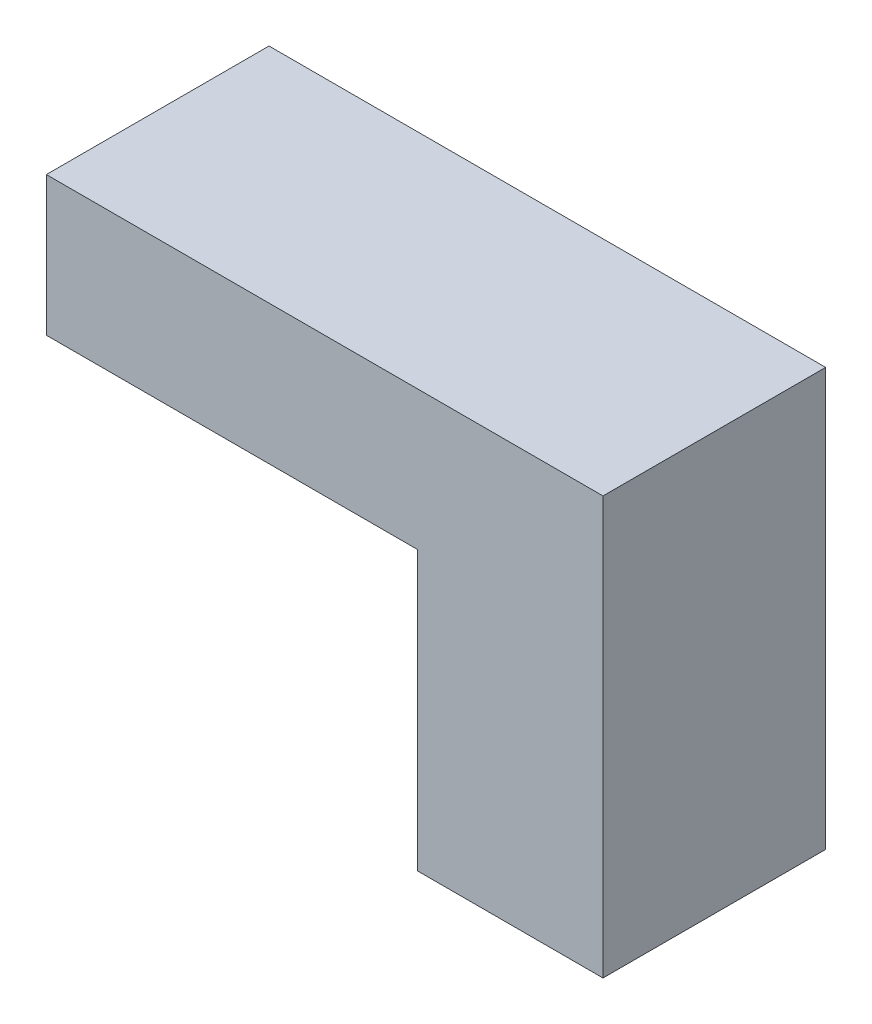
ISO-10303-21;
HEADER;
FILE_DESCRIPTION(('STEP AP214'),'2;1');
FILE_NAME('part.step','',(''),(''),'','','');
FILE_SCHEMA(('AUTOMOTIVE_DESIGN { 1 0 10303 214 1 1 1 1 }'));
ENDSEC;
DATA;
#1=APPLICATION_CONTEXT('core data for automotive mechanical design processes');
#2=APPLICATION_PROTOCOL_DEFINITION('international standard','automotive_design',2000,#1);
#3=PRODUCT_CONTEXT('',#1,'mechanical');
#4=PRODUCT('Part','Part','',(#3));
#5=PRODUCT_RELATED_PRODUCT_CATEGORY('part','',(#4));
#6=PRODUCT_DEFINITION_FORMATION('','',#4);
#7=PRODUCT_DEFINITION_CONTEXT('part definition',#1,'design');
#8=PRODUCT_DEFINITION('design','',#6,#7);
#9=PRODUCT_DEFINITION_SHAPE('','',#8);
#10=(LENGTH_UNIT() NAMED_UNIT(*) SI_UNIT(.MILLI.,.METRE.));
#11=(NAMED_UNIT(*) PLANE_ANGLE_UNIT() SI_UNIT($,.RADIAN.));
#12=(NAMED_UNIT(*) SI_UNIT($,.STERADIAN.) SOLID_ANGLE_UNIT());
#13=UNCERTAINTY_MEASURE_WITH_UNIT(LENGTH_MEASURE(1.E-05),#10,'distance_accuracy_value','');
#14=(GEOMETRIC_REPRESENTATION_CONTEXT(3) GLOBAL_UNCERTAINTY_ASSIGNED_CONTEXT((#13)) GLOBAL_UNIT_ASSIGNED_CONTEXT((#10,
#11,#12)) REPRESENTATION_CONTEXT('',''));
#15=CARTESIAN_POINT('',(0.,0.,0.));
#16=DIRECTION('',(0.,0.,1.));
#17=DIRECTION('',(1.,0.,0.));
#18=AXIS2_PLACEMENT_3D('',#15,#16,#17);
#19=CARTESIAN_POINT('',(0.,-3.81,6.096));
#20=DIRECTION('',(1.,0.,0.));
#21=DIRECTION('',(0.,0.,-1.));
#22=AXIS2_PLACEMENT_3D('',#19,#20,#21);
#23=PLANE('',#22);
#24=DIRECTION('',(0.,-1.,0.));
#25=VECTOR('',#24,1.);
#26=CARTESIAN_POINT('',(0.,-3.81,0.));
#27=LINE('',#26,#25);
#28=CARTESIAN_POINT('',(0.,0.,0.));
#29=VERTEX_POINT('',#28);
#30=CARTESIAN_POINT('',(0.,-3.81,0.));
#31=VERTEX_POINT('',#30);
#32=EDGE_CURVE('E117',#29,#31,#27,.T.);
#33=ORIENTED_EDGE('',*,*,#32,.T.);
#34=DIRECTION('',(0.,0.,-1.));
#35=VECTOR('',#34,1.);
#36=CARTESIAN_POINT('',(0.,-3.81,6.096));
#37=LINE('',#36,#35);
#38=CARTESIAN_POINT('',(0.,-3.81,6.096));
#39=VERTEX_POINT('',#38);
#40=EDGE_CURVE('E11',#39,#31,#37,.T.);
#41=ORIENTED_EDGE('',*,*,#40,.F.);
#42=DIRECTION('',(0.,-1.,0.));
#43=VECTOR('',#42,1.);
#44=CARTESIAN_POINT('',(0.,-3.81,6.096));
#45=LINE('',#44,#43);
#46=CARTESIAN_POINT('',(0.,0.,6.096));
#47=VERTEX_POINT('',#46);
#48=EDGE_CURVE('E127',#47,#39,#45,.T.);
#49=ORIENTED_EDGE('',*,*,#48,.F.);
#50=DIRECTION('',(0.,0.,-1.));
#51=VECTOR('',#50,1.);
#52=CARTESIAN_POINT('',(0.,0.,6.096));
#53=LINE('',#52,#51);
#54=EDGE_CURVE('E113',#47,#29,#53,.T.);
#55=ORIENTED_EDGE('',*,*,#54,.T.);
#56=EDGE_LOOP('',(#33,#41,#49,#55));
#57=FACE_BOUND('',#56,.T.);
#58=ADVANCED_FACE('F33',(#57),#23,.F.);
#59=CARTESIAN_POINT('',(10.16,-3.81,6.096));
#60=DIRECTION('',(0.,1.,0.));
#61=DIRECTION('',(-1.,0.,0.));
#62=AXIS2_PLACEMENT_3D('',#59,#60,#61);
#63=PLANE('',#62);
#64=DIRECTION('',(1.,0.,0.));
#65=VECTOR('',#64,1.);
#66=CARTESIAN_POINT('',(10.16,-3.81,0.));
#67=LINE('',#66,#65);
#68=CARTESIAN_POINT('',(10.16,-3.81,0.));
#69=VERTEX_POINT('',#68);
#70=EDGE_CURVE('E120',#31,#69,#67,.T.);
#71=ORIENTED_EDGE('',*,*,#70,.T.);
#72=DIRECTION('',(0.,0.,-1.));
#73=VECTOR('',#72,1.);
#74=CARTESIAN_POINT('',(10.16,-3.81,6.096));
#75=LINE('',#74,#73);
#76=CARTESIAN_POINT('',(10.16,-3.81,6.096));
#77=VERTEX_POINT('',#76);
#78=EDGE_CURVE('E41',#77,#69,#75,.T.);
#79=ORIENTED_EDGE('',*,*,#78,.F.);
#80=DIRECTION('',(1.,0.,0.));
#81=VECTOR('',#80,1.);
#82=CARTESIAN_POINT('',(10.16,-3.81,6.096));
#83=LINE('',#82,#81);
#84=EDGE_CURVE('E86',#39,#77,#83,.T.);
#85=ORIENTED_EDGE('',*,*,#84,.F.);
#86=ORIENTED_EDGE('',*,*,#40,.T.);
#87=EDGE_LOOP('',(#71,#79,#85,#86));
#88=FACE_BOUND('',#87,.T.);
#89=ADVANCED_FACE('F151',(#88),#63,.F.);
#90=CARTESIAN_POINT('',(10.16,-11.43,6.096));
#91=DIRECTION('',(1.,0.,0.));
#92=DIRECTION('',(0.,0.,-1.));
#93=AXIS2_PLACEMENT_3D('',#90,#91,#92);
#94=PLANE('',#93);
#95=DIRECTION('',(0.,-1.,0.));
#96=VECTOR('',#95,1.);
#97=CARTESIAN_POINT('',(10.16,-11.43,0.));
#98=LINE('',#97,#96);
#99=CARTESIAN_POINT('',(10.16,-11.43,0.));
#100=VERTEX_POINT('',#99);
#101=EDGE_CURVE('E122',#69,#100,#98,.T.);
#102=ORIENTED_EDGE('',*,*,#101,.T.);
#103=DIRECTION('',(0.,0.,-1.));
#104=VECTOR('',#103,1.);
#105=CARTESIAN_POINT('',(10.16,-11.43,6.096));
#106=LINE('',#105,#104);
#107=CARTESIAN_POINT('',(10.16,-11.43,6.096));
#108=VERTEX_POINT('',#107);
#109=EDGE_CURVE('E108',#108,#100,#106,.T.);
#110=ORIENTED_EDGE('',*,*,#109,.F.);
#111=DIRECTION('',(0.,-1.,0.));
#112=VECTOR('',#111,1.);
#113=CARTESIAN_POINT('',(10.16,-11.43,6.096));
#114=LINE('',#113,#112);
#115=EDGE_CURVE('E99',#77,#108,#114,.T.);
#116=ORIENTED_EDGE('',*,*,#115,.F.);
#117=ORIENTED_EDGE('',*,*,#78,.T.);
#118=EDGE_LOOP('',(#102,#110,#116,#117));
#119=FACE_BOUND('',#118,.T.);
#120=ADVANCED_FACE('F133',(#119),#94,.F.);
#121=CARTESIAN_POINT('',(15.24,-11.43,6.096));
#122=DIRECTION('',(0.,1.,0.));
#123=DIRECTION('',(0.,0.,1.));
#124=AXIS2_PLACEMENT_3D('',#121,#122,#123);
#125=PLANE('',#124);
#126=DIRECTION('',(1.,0.,0.));
#127=VECTOR('',#126,1.);
#128=CARTESIAN_POINT('',(15.24,-11.43,0.));
#129=LINE('',#128,#127);
#130=CARTESIAN_POINT('',(15.24,-11.43,0.));
#131=VERTEX_POINT('',#130);
#132=EDGE_CURVE('E107',#100,#131,#129,.T.);
#133=ORIENTED_EDGE('',*,*,#132,.T.);
#134=DIRECTION('',(0.,0.,-1.));
#135=VECTOR('',#134,1.);
#136=CARTESIAN_POINT('',(15.24,-11.43,6.096));
#137=LINE('',#136,#135);
#138=CARTESIAN_POINT('',(15.24,-11.43,6.096));
#139=VERTEX_POINT('',#138);
#140=EDGE_CURVE('E104',#139,#131,#137,.T.);
#141=ORIENTED_EDGE('',*,*,#140,.F.);
#142=DIRECTION('',(1.,0.,0.));
#143=VECTOR('',#142,1.);
#144=CARTESIAN_POINT('',(15.24,-11.43,6.096));
#145=LINE('',#144,#143);
#146=EDGE_CURVE('E93',#108,#139,#145,.T.);
#147=ORIENTED_EDGE('',*,*,#146,.F.);
#148=ORIENTED_EDGE('',*,*,#109,.T.);
#149=EDGE_LOOP('',(#133,#141,#147,#148));
#150=FACE_BOUND('',#149,.T.);
#151=ADVANCED_FACE('F105',(#150),#125,.F.);
#152=CARTESIAN_POINT('',(15.24,0.,6.096));
#153=DIRECTION('',(-1.,0.,0.));
#154=DIRECTION('',(0.,-1.,0.));
#155=AXIS2_PLACEMENT_3D('',#152,#153,#154);
#156=PLANE('',#155);
#157=DIRECTION('',(0.,1.,0.));
#158=VECTOR('',#157,1.);
#159=CARTESIAN_POINT('',(15.24,0.,0.));
#160=LINE('',#159,#158);
#161=CARTESIAN_POINT('',(15.24,0.,0.));
#162=VERTEX_POINT('',#161);
#163=EDGE_CURVE('E72',#131,#162,#160,.T.);
#164=ORIENTED_EDGE('',*,*,#163,.T.);
#165=DIRECTION('',(0.,0.,-1.));
#166=VECTOR('',#165,1.);
#167=CARTESIAN_POINT('',(15.24,0.,6.096));
#168=LINE('',#167,#166);
#169=CARTESIAN_POINT('',(15.24,0.,6.096));
#170=VERTEX_POINT('',#169);
#171=EDGE_CURVE('E109',#170,#162,#168,.T.);
#172=ORIENTED_EDGE('',*,*,#171,.F.);
#173=DIRECTION('',(0.,1.,0.));
#174=VECTOR('',#173,1.);
#175=CARTESIAN_POINT('',(15.24,0.,6.096));
#176=LINE('',#175,#174);
#177=EDGE_CURVE('E97',#139,#170,#176,.T.);
#178=ORIENTED_EDGE('',*,*,#177,.F.);
#179=ORIENTED_EDGE('',*,*,#140,.T.);
#180=EDGE_LOOP('',(#164,#172,#178,#179));
#181=FACE_BOUND('',#180,.T.);
#182=ADVANCED_FACE('F111',(#181),#156,.F.);
#183=CARTESIAN_POINT('',(0.,0.,6.096));
#184=DIRECTION('',(0.,-1.,0.));
#185=DIRECTION('',(0.,0.,-1.));
#186=AXIS2_PLACEMENT_3D('',#183,#184,#185);
#187=PLANE('',#186);
#188=DIRECTION('',(-1.,0.,0.));
#189=VECTOR('',#188,1.);
#190=CARTESIAN_POINT('',(0.,0.,0.));
#191=LINE('',#190,#189);
#192=EDGE_CURVE('E78',#162,#29,#191,.T.);
#193=ORIENTED_EDGE('',*,*,#192,.T.);
#194=ORIENTED_EDGE('',*,*,#54,.F.);
#195=DIRECTION('',(-1.,0.,0.));
#196=VECTOR('',#195,1.);
#197=CARTESIAN_POINT('',(0.,0.,6.096));
#198=LINE('',#197,#196);
#199=EDGE_CURVE('E49',#170,#47,#198,.T.);
#200=ORIENTED_EDGE('',*,*,#199,.F.);
#201=ORIENTED_EDGE('',*,*,#171,.T.);
#202=EDGE_LOOP('',(#193,#194,#200,#201));
#203=FACE_BOUND('',#202,.T.);
#204=ADVANCED_FACE('F140',(#203),#187,.F.);
#205=CARTESIAN_POINT('',(0.,0.,6.096));
#206=DIRECTION('',(0.,0.,-1.));
#207=DIRECTION('',(-1.,0.,0.));
#208=AXIS2_PLACEMENT_3D('',#205,#206,#207);
#209=PLANE('',#208);
#210=ORIENTED_EDGE('',*,*,#48,.T.);
#211=ORIENTED_EDGE('',*,*,#84,.T.);
#212=ORIENTED_EDGE('',*,*,#115,.T.);
#213=ORIENTED_EDGE('',*,*,#146,.T.);
#214=ORIENTED_EDGE('',*,*,#177,.T.);
#215=ORIENTED_EDGE('',*,*,#199,.T.);
#216=EDGE_LOOP('',(#210,#211,#212,#213,#214,#215));
#217=FACE_BOUND('',#216,.T.);
#218=ADVANCED_FACE('F95',(#217),#209,.F.);
#219=CARTESIAN_POINT('',(0.,0.,0.));
#220=DIRECTION('',(0.,0.,-1.));
#221=DIRECTION('',(-1.,0.,0.));
#222=AXIS2_PLACEMENT_3D('',#219,#220,#221);
#223=PLANE('',#222);
#224=ORIENTED_EDGE('',*,*,#32,.F.);
#225=ORIENTED_EDGE('',*,*,#192,.F.);
#226=ORIENTED_EDGE('',*,*,#163,.F.);
#227=ORIENTED_EDGE('',*,*,#132,.F.);
#228=ORIENTED_EDGE('',*,*,#101,.F.);
#229=ORIENTED_EDGE('',*,*,#70,.F.);
#230=EDGE_LOOP('',(#224,#225,#226,#227,#228,#229));
#231=FACE_BOUND('',#230,.T.);
#232=ADVANCED_FACE('F136',(#231),#223,.T.);
#233=CLOSED_SHELL('',(#58,#89,#120,#151,#182,#204,#218,#232));
#234=MANIFOLD_SOLID_BREP('B2',#233);
#235=ADVANCED_BREP_SHAPE_REPRESENTATION('',(#18,#234),#14);
#236=SHAPE_DEFINITION_REPRESENTATION(#9,#235);
ENDSEC;
END-ISO-10303-21;
